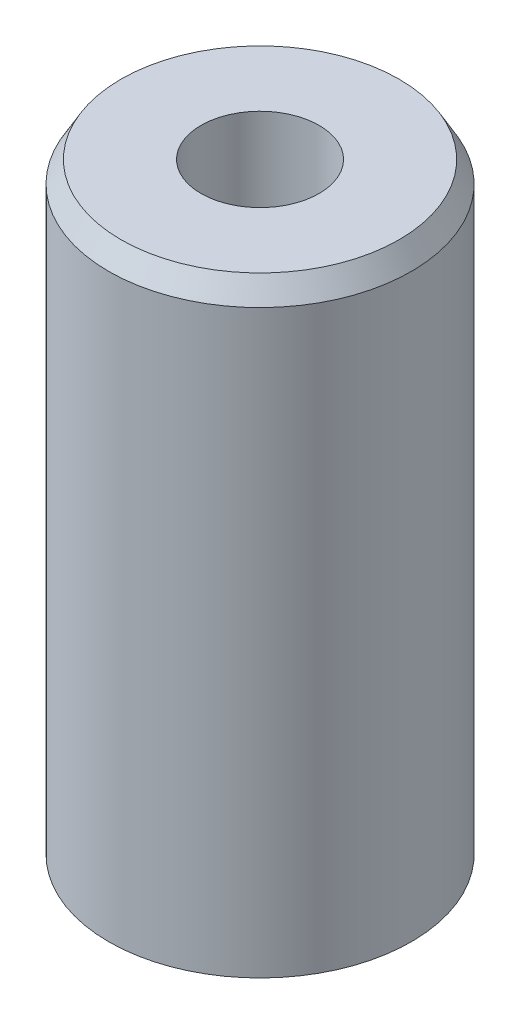
ISO-10303-21;
HEADER;
FILE_DESCRIPTION(('STEP AP214'),'2;1');
FILE_NAME('part.step','',(''),(''),'','','');
FILE_SCHEMA(('AUTOMOTIVE_DESIGN { 1 0 10303 214 1 1 1 1 }'));
ENDSEC;
DATA;
#1=APPLICATION_CONTEXT('core data for automotive mechanical design processes');
#2=APPLICATION_PROTOCOL_DEFINITION('international standard','automotive_design',2000,#1);
#3=PRODUCT_CONTEXT('',#1,'mechanical');
#4=PRODUCT('Part','Part','',(#3));
#5=PRODUCT_RELATED_PRODUCT_CATEGORY('part','',(#4));
#6=PRODUCT_DEFINITION_FORMATION('','',#4);
#7=PRODUCT_DEFINITION_CONTEXT('part definition',#1,'design');
#8=PRODUCT_DEFINITION('design','',#6,#7);
#9=PRODUCT_DEFINITION_SHAPE('','',#8);
#10=(LENGTH_UNIT() NAMED_UNIT(*) SI_UNIT(.MILLI.,.METRE.));
#11=(NAMED_UNIT(*) PLANE_ANGLE_UNIT() SI_UNIT($,.RADIAN.));
#12=(NAMED_UNIT(*) SI_UNIT($,.STERADIAN.) SOLID_ANGLE_UNIT());
#13=UNCERTAINTY_MEASURE_WITH_UNIT(LENGTH_MEASURE(1.E-05),#10,'distance_accuracy_value','');
#14=(GEOMETRIC_REPRESENTATION_CONTEXT(3) GLOBAL_UNCERTAINTY_ASSIGNED_CONTEXT((#13)) GLOBAL_UNIT_ASSIGNED_CONTEXT((#10,
#11,#12)) REPRESENTATION_CONTEXT('',''));
#15=CARTESIAN_POINT('',(0.,0.,0.));
#16=DIRECTION('',(0.,0.,1.));
#17=DIRECTION('',(1.,0.,0.));
#18=AXIS2_PLACEMENT_3D('',#15,#16,#17);
#19=CARTESIAN_POINT('',(0.,101.440218567857,0.));
#20=DIRECTION('',(0.,-1.,0.));
#21=DIRECTION('',(0.,0.,-1.));
#22=AXIS2_PLACEMENT_3D('',#19,#20,#21);
#23=CYLINDRICAL_SURFACE('',#22,25.);
#24=CARTESIAN_POINT('',(0.,97.9232102970625,0.));
#25=DIRECTION('',(0.,1.,0.));
#26=DIRECTION('',(0.,0.,1.));
#27=AXIS2_PLACEMENT_3D('',#24,#25,#26);
#28=CIRCLE('',#27,25.);
#29=CARTESIAN_POINT('',(0.,97.9232102970625,25.));
#30=VERTEX_POINT('',#29);
#31=EDGE_CURVE('E50',#30,#30,#28,.F.);
#32=ORIENTED_EDGE('',*,*,#31,.T.);
#33=EDGE_LOOP('',(#32));
#34=FACE_BOUND('',#33,.T.);
#35=CARTESIAN_POINT('',(0.,2.03054567188551,0.));
#36=DIRECTION('',(0.,1.,0.));
#37=DIRECTION('',(0.,0.,1.));
#38=AXIS2_PLACEMENT_3D('',#35,#36,#37);
#39=CIRCLE('',#38,25.);
#40=CARTESIAN_POINT('',(0.,2.03054567188551,25.));
#41=VERTEX_POINT('',#40);
#42=EDGE_CURVE('E51',#41,#41,#39,.T.);
#43=ORIENTED_EDGE('',*,*,#42,.T.);
#44=EDGE_LOOP('',(#43));
#45=FACE_BOUND('',#44,.T.);
#46=ADVANCED_FACE('F39',(#34,#45),#23,.T.);
#47=CARTESIAN_POINT('',(0.,101.440218567857,0.));
#48=DIRECTION('',(0.,1.,0.));
#49=DIRECTION('',(0.,0.,1.));
#50=AXIS2_PLACEMENT_3D('',#47,#48,#49);
#51=PLANE('',#50);
#52=CARTESIAN_POINT('',(0.,101.440218567857,0.));
#53=DIRECTION('',(0.,1.,0.));
#54=DIRECTION('',(0.,0.,1.));
#55=AXIS2_PLACEMENT_3D('',#52,#53,#54);
#56=CIRCLE('',#55,22.9694543281145);
#57=CARTESIAN_POINT('',(0.,101.440218567857,22.9694543281145));
#58=VERTEX_POINT('',#57);
#59=EDGE_CURVE('E54',#58,#58,#56,.T.);
#60=ORIENTED_EDGE('',*,*,#59,.T.);
#61=EDGE_LOOP('',(#60));
#62=FACE_BOUND('',#61,.T.);
#63=CARTESIAN_POINT('',(0.,101.440218567857,0.));
#64=DIRECTION('',(0.,1.,0.));
#65=DIRECTION('',(0.,0.,1.));
#66=AXIS2_PLACEMENT_3D('',#63,#64,#65);
#67=CIRCLE('',#66,9.75555942908015);
#68=CARTESIAN_POINT('',(0.,101.440218567857,9.75555942908015));
#69=VERTEX_POINT('',#68);
#70=EDGE_CURVE('E58',#69,#69,#67,.T.);
#71=ORIENTED_EDGE('',*,*,#70,.F.);
#72=EDGE_LOOP('',(#71));
#73=FACE_BOUND('',#72,.T.);
#74=ADVANCED_FACE('F69',(#62,#73),#51,.T.);
#75=CARTESIAN_POINT('',(0.,0.,0.));
#76=DIRECTION('',(0.,1.,0.));
#77=DIRECTION('',(0.,0.,1.));
#78=AXIS2_PLACEMENT_3D('',#75,#76,#77);
#79=PLANE('',#78);
#80=CARTESIAN_POINT('',(0.,0.,0.));
#81=DIRECTION('',(0.,1.,0.));
#82=DIRECTION('',(0.,0.,1.));
#83=AXIS2_PLACEMENT_3D('',#80,#81,#82);
#84=CIRCLE('',#83,21.4829917292052);
#85=CARTESIAN_POINT('',(0.,0.,21.4829917292052));
#86=VERTEX_POINT('',#85);
#87=EDGE_CURVE('E10',#86,#86,#84,.F.);
#88=ORIENTED_EDGE('',*,*,#87,.T.);
#89=EDGE_LOOP('',(#88));
#90=FACE_BOUND('',#89,.T.);
#91=CARTESIAN_POINT('',(0.,0.,0.));
#92=DIRECTION('',(0.,1.,0.));
#93=DIRECTION('',(0.,0.,1.));
#94=AXIS2_PLACEMENT_3D('',#91,#92,#93);
#95=CIRCLE('',#94,9.75555942908015);
#96=CARTESIAN_POINT('',(0.,0.,9.75555942908015));
#97=VERTEX_POINT('',#96);
#98=EDGE_CURVE('E63',#97,#97,#95,.T.);
#99=ORIENTED_EDGE('',*,*,#98,.T.);
#100=EDGE_LOOP('',(#99));
#101=FACE_BOUND('',#100,.T.);
#102=ADVANCED_FACE('F75',(#90,#101),#79,.F.);
#103=CARTESIAN_POINT('',(0.,101.440218567857,0.));
#104=DIRECTION('',(0.,-1.,0.));
#105=DIRECTION('',(0.,0.,-1.));
#106=AXIS2_PLACEMENT_3D('',#103,#104,#105);
#107=CYLINDRICAL_SURFACE('',#106,9.75555942908015);
#108=ORIENTED_EDGE('',*,*,#70,.T.);
#109=EDGE_LOOP('',(#108));
#110=FACE_BOUND('',#109,.T.);
#111=ORIENTED_EDGE('',*,*,#98,.F.);
#112=EDGE_LOOP('',(#111));
#113=FACE_BOUND('',#112,.T.);
#114=ADVANCED_FACE('F70',(#110,#113),#107,.F.);
#115=CARTESIAN_POINT('',(0.,101.440218567857,0.));
#116=DIRECTION('',(0.,-1.,0.));
#117=DIRECTION('',(0.,0.,-1.));
#118=AXIS2_PLACEMENT_3D('',#115,#116,#117);
#119=CONICAL_SURFACE('',#118,22.9694543281145,0.523598775598298);
#120=ORIENTED_EDGE('',*,*,#31,.F.);
#121=EDGE_LOOP('',(#120));
#122=FACE_BOUND('',#121,.T.);
#123=ORIENTED_EDGE('',*,*,#59,.F.);
#124=EDGE_LOOP('',(#123));
#125=FACE_BOUND('',#124,.T.);
#126=ADVANCED_FACE('F81',(#122,#125),#119,.T.);
#127=CARTESIAN_POINT('',(0.,2.03054567188551,0.));
#128=DIRECTION('',(0.,1.,0.));
#129=DIRECTION('',(0.,0.,1.));
#130=AXIS2_PLACEMENT_3D('',#127,#128,#129);
#131=CONICAL_SURFACE('',#130,25.,1.0471975511966);
#132=ORIENTED_EDGE('',*,*,#87,.F.);
#133=EDGE_LOOP('',(#132));
#134=FACE_BOUND('',#133,.T.);
#135=ORIENTED_EDGE('',*,*,#42,.F.);
#136=EDGE_LOOP('',(#135));
#137=FACE_BOUND('',#136,.T.);
#138=ADVANCED_FACE('F45',(#134,#137),#131,.T.);
#139=CLOSED_SHELL('',(#46,#74,#102,#114,#126,#138));
#140=MANIFOLD_SOLID_BREP('B2',#139);
#141=ADVANCED_BREP_SHAPE_REPRESENTATION('',(#18,#140),#14);
#142=SHAPE_DEFINITION_REPRESENTATION(#9,#141);
ENDSEC;
END-ISO-10303-21;
